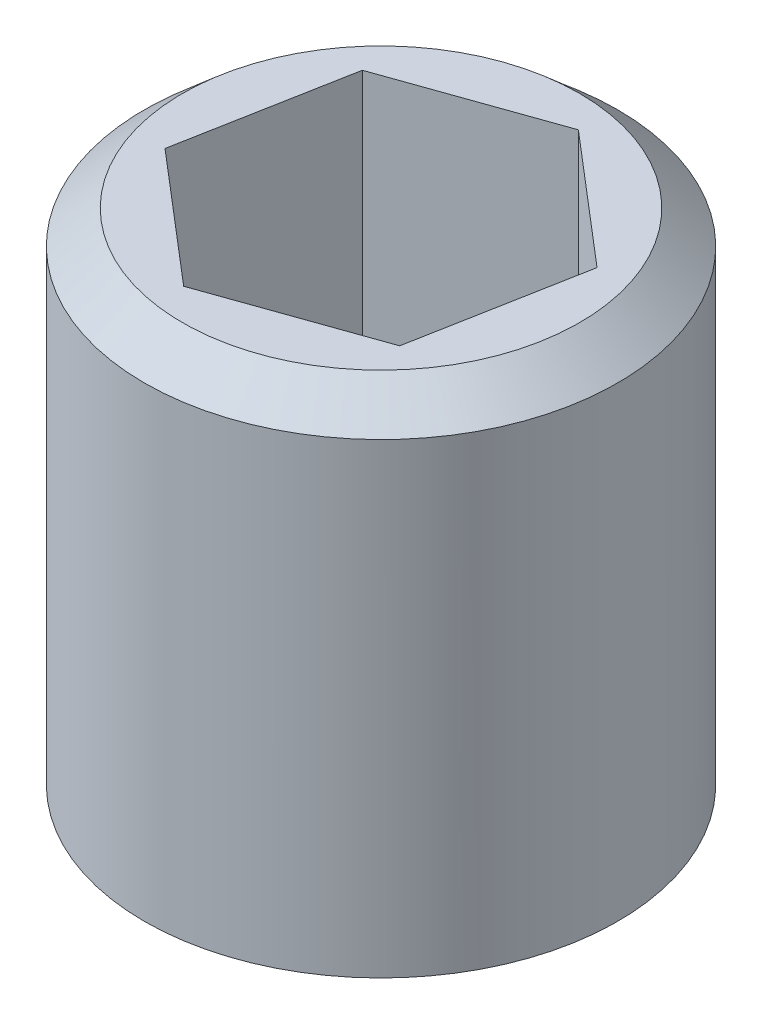
ISO-10303-21;
HEADER;
FILE_DESCRIPTION(('STEP AP214'),'2;1');
FILE_NAME('part.step','',(''),(''),'','','');
FILE_SCHEMA(('AUTOMOTIVE_DESIGN { 1 0 10303 214 1 1 1 1 }'));
ENDSEC;
DATA;
#1=APPLICATION_CONTEXT('core data for automotive mechanical design processes');
#2=APPLICATION_PROTOCOL_DEFINITION('international standard','automotive_design',2000,#1);
#3=PRODUCT_CONTEXT('',#1,'mechanical');
#4=PRODUCT('Part','Part','',(#3));
#5=PRODUCT_RELATED_PRODUCT_CATEGORY('part','',(#4));
#6=PRODUCT_DEFINITION_FORMATION('','',#4);
#7=PRODUCT_DEFINITION_CONTEXT('part definition',#1,'design');
#8=PRODUCT_DEFINITION('design','',#6,#7);
#9=PRODUCT_DEFINITION_SHAPE('','',#8);
#10=(LENGTH_UNIT() NAMED_UNIT(*) SI_UNIT(.MILLI.,.METRE.));
#11=(NAMED_UNIT(*) PLANE_ANGLE_UNIT() SI_UNIT($,.RADIAN.));
#12=(NAMED_UNIT(*) SI_UNIT($,.STERADIAN.) SOLID_ANGLE_UNIT());
#13=UNCERTAINTY_MEASURE_WITH_UNIT(LENGTH_MEASURE(1.E-05),#10,'distance_accuracy_value','');
#14=(GEOMETRIC_REPRESENTATION_CONTEXT(3) GLOBAL_UNCERTAINTY_ASSIGNED_CONTEXT((#13)) GLOBAL_UNIT_ASSIGNED_CONTEXT((#10,
#11,#12)) REPRESENTATION_CONTEXT('',''));
#15=CARTESIAN_POINT('',(0.,0.,0.));
#16=DIRECTION('',(0.,0.,1.));
#17=DIRECTION('',(1.,0.,0.));
#18=AXIS2_PLACEMENT_3D('',#15,#16,#17);
#19=CARTESIAN_POINT('',(-1.08864309110928,6.,4.10995396284928));
#20=DIRECTION('',(-0.649792362774476,0.,0.760111758414488));
#21=DIRECTION('',(0.760111758414488,0.,0.649792362774476));
#22=AXIS2_PLACEMENT_3D('',#19,#20,#21);
#23=PLANE('',#22);
#24=DIRECTION('',(0.,1.,0.));
#25=VECTOR('',#24,1.);
#26=CARTESIAN_POINT('',(-0.210941634439672,6.,4.86026955397969));
#27=LINE('',#26,#25);
#28=CARTESIAN_POINT('',(-0.210941634439673,9.,4.86026955397969));
#29=VERTEX_POINT('',#28);
#30=CARTESIAN_POINT('',(-0.210941634439673,6.,4.86026955397969));
#31=VERTEX_POINT('',#30);
#32=EDGE_CURVE('E83',#29,#31,#27,.F.);
#33=ORIENTED_EDGE('',*,*,#32,.T.);
#34=DIRECTION('',(0.760111758414488,0.,0.649792362774476));
#35=VECTOR('',#34,1.);
#36=CARTESIAN_POINT('',(-1.08864309110928,6.,4.10995396284928));
#37=LINE('',#36,#35);
#38=CARTESIAN_POINT('',(-1.08864309110928,6.,4.10995396284928));
#39=VERTEX_POINT('',#38);
#40=EDGE_CURVE('E72',#39,#31,#37,.T.);
#41=ORIENTED_EDGE('',*,*,#40,.F.);
#42=DIRECTION('',(0.,1.,0.));
#43=VECTOR('',#42,1.);
#44=CARTESIAN_POINT('',(-1.08864309110928,6.,4.10995396284928));
#45=LINE('',#44,#43);
#46=CARTESIAN_POINT('',(-1.08864309110928,9.,4.10995396284928));
#47=VERTEX_POINT('',#46);
#48=EDGE_CURVE('E91',#39,#47,#45,.T.);
#49=ORIENTED_EDGE('',*,*,#48,.T.);
#50=DIRECTION('',(0.760111758414488,0.,0.649792362774476));
#51=VECTOR('',#50,1.);
#52=CARTESIAN_POINT('',(-1.08864309110928,9.,4.10995396284928));
#53=LINE('',#52,#51);
#54=EDGE_CURVE('E67',#29,#47,#53,.F.);
#55=ORIENTED_EDGE('',*,*,#54,.F.);
#56=EDGE_LOOP('',(#33,#41,#49,#55));
#57=FACE_BOUND('',#56,.T.);
#58=ADVANCED_FACE('F17',(#57),#23,.F.);
#59=CARTESIAN_POINT('',(-0.210941634439672,6.,4.86026955397969));
#60=DIRECTION('',(0.333379911114968,0.,0.942792572555054));
#61=DIRECTION('',(0.942792572555054,0.,-0.333379911114968));
#62=AXIS2_PLACEMENT_3D('',#59,#60,#61);
#63=PLANE('',#62);
#64=DIRECTION('',(0.,1.,0.));
#65=VECTOR('',#64,1.);
#66=CARTESIAN_POINT('',(0.877701456669609,6.,4.47531559113041));
#67=LINE('',#66,#65);
#68=CARTESIAN_POINT('',(0.877701456669609,9.,4.47531559113041));
#69=VERTEX_POINT('',#68);
#70=CARTESIAN_POINT('',(0.877701456669609,6.,4.47531559113041));
#71=VERTEX_POINT('',#70);
#72=EDGE_CURVE('E87',#69,#71,#67,.F.);
#73=ORIENTED_EDGE('',*,*,#72,.T.);
#74=DIRECTION('',(0.942792572555054,0.,-0.333379911114968));
#75=VECTOR('',#74,1.);
#76=CARTESIAN_POINT('',(-0.210941634439672,6.,4.86026955397969));
#77=LINE('',#76,#75);
#78=EDGE_CURVE('E76',#31,#71,#77,.T.);
#79=ORIENTED_EDGE('',*,*,#78,.F.);
#80=ORIENTED_EDGE('',*,*,#32,.F.);
#81=DIRECTION('',(0.942792572555054,0.,-0.333379911114968));
#82=VECTOR('',#81,1.);
#83=CARTESIAN_POINT('',(-0.210941634439672,9.,4.86026955397969));
#84=LINE('',#83,#82);
#85=EDGE_CURVE('E89',#69,#29,#84,.F.);
#86=ORIENTED_EDGE('',*,*,#85,.F.);
#87=EDGE_LOOP('',(#73,#79,#80,#86));
#88=FACE_BOUND('',#87,.T.);
#89=ADVANCED_FACE('F86',(#88),#63,.F.);
#90=CARTESIAN_POINT('',(-0.877701456669609,6.,2.97468440886959));
#91=DIRECTION('',(-0.983172273889444,0.,-0.182680814140566));
#92=DIRECTION('',(-0.182680814140566,0.,0.983172273889444));
#93=AXIS2_PLACEMENT_3D('',#90,#91,#92);
#94=PLANE('',#93);
#95=ORIENTED_EDGE('',*,*,#48,.F.);
#96=DIRECTION('',(-0.182680814140566,0.,0.983172273889444));
#97=VECTOR('',#96,1.);
#98=CARTESIAN_POINT('',(-0.877701456669609,6.,2.97468440886959));
#99=LINE('',#98,#97);
#100=CARTESIAN_POINT('',(-0.877701456669609,6.,2.97468440886959));
#101=VERTEX_POINT('',#100);
#102=EDGE_CURVE('E79',#101,#39,#99,.T.);
#103=ORIENTED_EDGE('',*,*,#102,.F.);
#104=DIRECTION('',(0.,1.,0.));
#105=VECTOR('',#104,1.);
#106=CARTESIAN_POINT('',(-0.877701456669609,6.,2.97468440886959));
#107=LINE('',#106,#105);
#108=CARTESIAN_POINT('',(-0.877701456669609,9.,2.97468440886959));
#109=VERTEX_POINT('',#108);
#110=EDGE_CURVE('E120',#101,#109,#107,.T.);
#111=ORIENTED_EDGE('',*,*,#110,.T.);
#112=DIRECTION('',(-0.182680814140566,0.,0.983172273889444));
#113=VECTOR('',#112,1.);
#114=CARTESIAN_POINT('',(-0.877701456669609,9.,2.97468440886959));
#115=LINE('',#114,#113);
#116=EDGE_CURVE('E130',#47,#109,#115,.F.);
#117=ORIENTED_EDGE('',*,*,#116,.F.);
#118=EDGE_LOOP('',(#95,#103,#111,#117));
#119=FACE_BOUND('',#118,.T.);
#120=ADVANCED_FACE('F133',(#119),#94,.F.);
#121=CARTESIAN_POINT('',(0.877701456669609,6.,4.47531559113041));
#122=DIRECTION('',(0.983172273889444,0.,0.182680814140566));
#123=DIRECTION('',(0.182680814140566,0.,-0.983172273889444));
#124=AXIS2_PLACEMENT_3D('',#121,#122,#123);
#125=PLANE('',#124);
#126=DIRECTION('',(0.,1.,0.));
#127=VECTOR('',#126,1.);
#128=CARTESIAN_POINT('',(1.08864309110928,6.,3.34004603715072));
#129=LINE('',#128,#127);
#130=CARTESIAN_POINT('',(1.08864309110928,9.,3.34004603715072));
#131=VERTEX_POINT('',#130);
#132=CARTESIAN_POINT('',(1.08864309110928,6.,3.34004603715072));
#133=VERTEX_POINT('',#132);
#134=EDGE_CURVE('E116',#131,#133,#129,.F.);
#135=ORIENTED_EDGE('',*,*,#134,.T.);
#136=DIRECTION('',(0.182680814140566,0.,-0.983172273889444));
#137=VECTOR('',#136,1.);
#138=CARTESIAN_POINT('',(0.877701456669609,6.,4.47531559113041));
#139=LINE('',#138,#137);
#140=EDGE_CURVE('E126',#71,#133,#139,.T.);
#141=ORIENTED_EDGE('',*,*,#140,.F.);
#142=ORIENTED_EDGE('',*,*,#72,.F.);
#143=DIRECTION('',(0.182680814140566,0.,-0.983172273889444));
#144=VECTOR('',#143,1.);
#145=CARTESIAN_POINT('',(0.877701456669609,9.,4.47531559113041));
#146=LINE('',#145,#144);
#147=EDGE_CURVE('E35',#131,#69,#146,.F.);
#148=ORIENTED_EDGE('',*,*,#147,.F.);
#149=EDGE_LOOP('',(#135,#141,#142,#148));
#150=FACE_BOUND('',#149,.T.);
#151=ADVANCED_FACE('F138',(#150),#125,.F.);
#152=CARTESIAN_POINT('',(0.,6.,0.));
#153=DIRECTION('',(0.,1.,0.));
#154=DIRECTION('',(0.,0.,1.));
#155=AXIS2_PLACEMENT_3D('',#152,#153,#154);
#156=PLANE('',#155);
#157=ORIENTED_EDGE('',*,*,#40,.T.);
#158=ORIENTED_EDGE('',*,*,#78,.T.);
#159=ORIENTED_EDGE('',*,*,#140,.T.);
#160=DIRECTION('',(-0.760111758414488,0.,-0.649792362774475));
#161=VECTOR('',#160,1.);
#162=CARTESIAN_POINT('',(1.08864309110928,6.,3.34004603715072));
#163=LINE('',#162,#161);
#164=CARTESIAN_POINT('',(0.210941634439671,6.,2.58973044602031));
#165=VERTEX_POINT('',#164);
#166=EDGE_CURVE('E112',#133,#165,#163,.T.);
#167=ORIENTED_EDGE('',*,*,#166,.T.);
#168=DIRECTION('',(-0.942792572555053,0.,0.333379911114969));
#169=VECTOR('',#168,1.);
#170=CARTESIAN_POINT('',(0.210941634439671,6.,2.58973044602031));
#171=LINE('',#170,#169);
#172=EDGE_CURVE('E123',#165,#101,#171,.T.);
#173=ORIENTED_EDGE('',*,*,#172,.T.);
#174=ORIENTED_EDGE('',*,*,#102,.T.);
#175=EDGE_LOOP('',(#157,#158,#159,#167,#173,#174));
#176=FACE_BOUND('',#175,.T.);
#177=ADVANCED_FACE('F73',(#176),#156,.T.);
#178=CARTESIAN_POINT('',(0.210941634439671,6.,2.58973044602031));
#179=DIRECTION('',(-0.333379911114969,0.,-0.942792572555053));
#180=DIRECTION('',(-0.942792572555053,0.,0.333379911114969));
#181=AXIS2_PLACEMENT_3D('',#178,#179,#180);
#182=PLANE('',#181);
#183=ORIENTED_EDGE('',*,*,#110,.F.);
#184=ORIENTED_EDGE('',*,*,#172,.F.);
#185=DIRECTION('',(0.,1.,0.));
#186=VECTOR('',#185,1.);
#187=CARTESIAN_POINT('',(0.210941634439672,6.,2.58973044602031));
#188=LINE('',#187,#186);
#189=CARTESIAN_POINT('',(0.210941634439671,9.,2.58973044602031));
#190=VERTEX_POINT('',#189);
#191=EDGE_CURVE('E106',#165,#190,#188,.T.);
#192=ORIENTED_EDGE('',*,*,#191,.T.);
#193=DIRECTION('',(-0.942792572555053,0.,0.333379911114969));
#194=VECTOR('',#193,1.);
#195=CARTESIAN_POINT('',(0.210941634439671,9.,2.58973044602031));
#196=LINE('',#195,#194);
#197=EDGE_CURVE('E117',#109,#190,#196,.F.);
#198=ORIENTED_EDGE('',*,*,#197,.F.);
#199=EDGE_LOOP('',(#183,#184,#192,#198));
#200=FACE_BOUND('',#199,.T.);
#201=ADVANCED_FACE('F143',(#200),#182,.F.);
#202=CARTESIAN_POINT('',(1.08864309110928,6.,3.34004603715072));
#203=DIRECTION('',(0.649792362774475,0.,-0.760111758414488));
#204=DIRECTION('',(-0.760111758414488,0.,-0.649792362774475));
#205=AXIS2_PLACEMENT_3D('',#202,#203,#204);
#206=PLANE('',#205);
#207=ORIENTED_EDGE('',*,*,#191,.F.);
#208=ORIENTED_EDGE('',*,*,#166,.F.);
#209=ORIENTED_EDGE('',*,*,#134,.F.);
#210=DIRECTION('',(-0.760111758414489,0.,-0.649792362774474));
#211=VECTOR('',#210,1.);
#212=CARTESIAN_POINT('',(1.08864309110928,9.,3.34004603715072));
#213=LINE('',#212,#211);
#214=EDGE_CURVE('E102',#131,#190,#213,.T.);
#215=ORIENTED_EDGE('',*,*,#214,.T.);
#216=EDGE_LOOP('',(#207,#208,#209,#215));
#217=FACE_BOUND('',#216,.T.);
#218=ADVANCED_FACE('F141',(#217),#206,.F.);
#219=CARTESIAN_POINT('',(0.,5.,4.32082802539439));
#220=DIRECTION('',(0.,1.,0.));
#221=DIRECTION('',(0.,0.,1.));
#222=AXIS2_PLACEMENT_3D('',#219,#220,#221);
#223=PLANE('',#222);
#224=CARTESIAN_POINT('',(0.,4.99999999997724,3.725));
#225=DIRECTION('',(0.,1.,0.));
#226=DIRECTION('',(0.,0.,1.));
#227=AXIS2_PLACEMENT_3D('',#224,#225,#226);
#228=CIRCLE('',#227,0.595828025325318);
#229=CARTESIAN_POINT('',(0.,4.99999999997724,4.32082802532532));
#230=VERTEX_POINT('',#229);
#231=EDGE_CURVE('E20',#230,#230,#228,.T.);
#232=ORIENTED_EDGE('',*,*,#231,.F.);
#233=EDGE_LOOP('',(#232));
#234=FACE_BOUND('',#233,.T.);
#235=ADVANCED_FACE('F151',(#234),#223,.F.);
#236=CARTESIAN_POINT('',(0.,9.,3.725));
#237=DIRECTION('',(0.,-1.,0.));
#238=DIRECTION('',(0.,0.,-1.));
#239=AXIS2_PLACEMENT_3D('',#236,#237,#238);
#240=PLANE('',#239);
#241=CARTESIAN_POINT('',(0.,9.00000000005149,3.725));
#242=DIRECTION('',(0.,-1.,0.));
#243=DIRECTION('',(0.,0.,-1.));
#244=AXIS2_PLACEMENT_3D('',#241,#242,#243);
#245=CIRCLE('',#244,1.35442592875279);
#246=CARTESIAN_POINT('',(0.,9.00000000005149,2.37057407124721));
#247=VERTEX_POINT('',#246);
#248=EDGE_CURVE('E95',#247,#247,#245,.T.);
#249=ORIENTED_EDGE('',*,*,#248,.F.);
#250=EDGE_LOOP('',(#249));
#251=FACE_BOUND('',#250,.T.);
#252=ORIENTED_EDGE('',*,*,#147,.T.);
#253=ORIENTED_EDGE('',*,*,#85,.T.);
#254=ORIENTED_EDGE('',*,*,#54,.T.);
#255=ORIENTED_EDGE('',*,*,#116,.T.);
#256=ORIENTED_EDGE('',*,*,#197,.T.);
#257=ORIENTED_EDGE('',*,*,#214,.F.);
#258=EDGE_LOOP('',(#252,#253,#254,#255,#256,#257));
#259=FACE_BOUND('',#258,.T.);
#260=ADVANCED_FACE('F137',(#251,#259),#240,.F.);
#261=CARTESIAN_POINT('',(0.,5.59286359862199,3.725));
#262=DIRECTION('',(0.,1.,0.));
#263=DIRECTION('',(0.,0.,1.));
#264=AXIS2_PLACEMENT_3D('',#261,#262,#263);
#265=CONICAL_SURFACE('',#264,1.61433728462443,1.04365038324644);
#266=CARTESIAN_POINT('',(0.,5.59286359862151,3.725));
#267=DIRECTION('',(0.,1.,0.));
#268=DIRECTION('',(0.,0.,1.));
#269=AXIS2_PLACEMENT_3D('',#266,#267,#268);
#270=CIRCLE('',#269,1.61433728456468);
#271=CARTESIAN_POINT('',(0.,5.59286359862151,5.33933728456468));
#272=VERTEX_POINT('',#271);
#273=EDGE_CURVE('E26',#272,#272,#270,.T.);
#274=ORIENTED_EDGE('',*,*,#273,.F.);
#275=EDGE_LOOP('',(#274));
#276=FACE_BOUND('',#275,.T.);
#277=ORIENTED_EDGE('',*,*,#231,.T.);
#278=EDGE_LOOP('',(#277));
#279=FACE_BOUND('',#278,.T.);
#280=ADVANCED_FACE('F162',(#276,#279),#265,.T.);
#281=CARTESIAN_POINT('',(0.,8.77366078287878,3.725));
#282=DIRECTION('',(0.,-1.,0.));
#283=DIRECTION('',(0.,0.,-1.));
#284=AXIS2_PLACEMENT_3D('',#281,#282,#283);
#285=CONICAL_SURFACE('',#284,1.61433728450502,0.854331646015683);
#286=ORIENTED_EDGE('',*,*,#248,.T.);
#287=EDGE_LOOP('',(#286));
#288=FACE_BOUND('',#287,.T.);
#289=CARTESIAN_POINT('',(0.,8.7736607828091,3.725));
#290=DIRECTION('',(0.,1.,0.));
#291=DIRECTION('',(0.,0.,1.));
#292=AXIS2_PLACEMENT_3D('',#289,#290,#291);
#293=CIRCLE('',#292,1.61433728456468);
#294=CARTESIAN_POINT('',(0.,8.7736607828091,5.33933728456468));
#295=VERTEX_POINT('',#294);
#296=EDGE_CURVE('E11',#295,#295,#293,.F.);
#297=ORIENTED_EDGE('',*,*,#296,.F.);
#298=EDGE_LOOP('',(#297));
#299=FACE_BOUND('',#298,.T.);
#300=ADVANCED_FACE('F156',(#288,#299),#285,.T.);
#301=CARTESIAN_POINT('',(0.,1.49143096545149,3.725));
#302=DIRECTION('',(0.,1.,0.));
#303=DIRECTION('',(0.,0.,1.));
#304=AXIS2_PLACEMENT_3D('',#301,#302,#303);
#305=CYLINDRICAL_SURFACE('',#304,1.61433728456468);
#306=ORIENTED_EDGE('',*,*,#273,.T.);
#307=EDGE_LOOP('',(#306));
#308=FACE_BOUND('',#307,.T.);
#309=ORIENTED_EDGE('',*,*,#296,.T.);
#310=EDGE_LOOP('',(#309));
#311=FACE_BOUND('',#310,.T.);
#312=ADVANCED_FACE('F154',(#308,#311),#305,.T.);
#313=CLOSED_SHELL('',(#58,#89,#120,#151,#177,#201,#218,#235,#260,#280,#300,#312));
#314=MANIFOLD_SOLID_BREP('B1',#313);
#315=ADVANCED_BREP_SHAPE_REPRESENTATION('',(#18,#314),#14);
#316=SHAPE_DEFINITION_REPRESENTATION(#9,#315);
ENDSEC;
END-ISO-10303-21;
